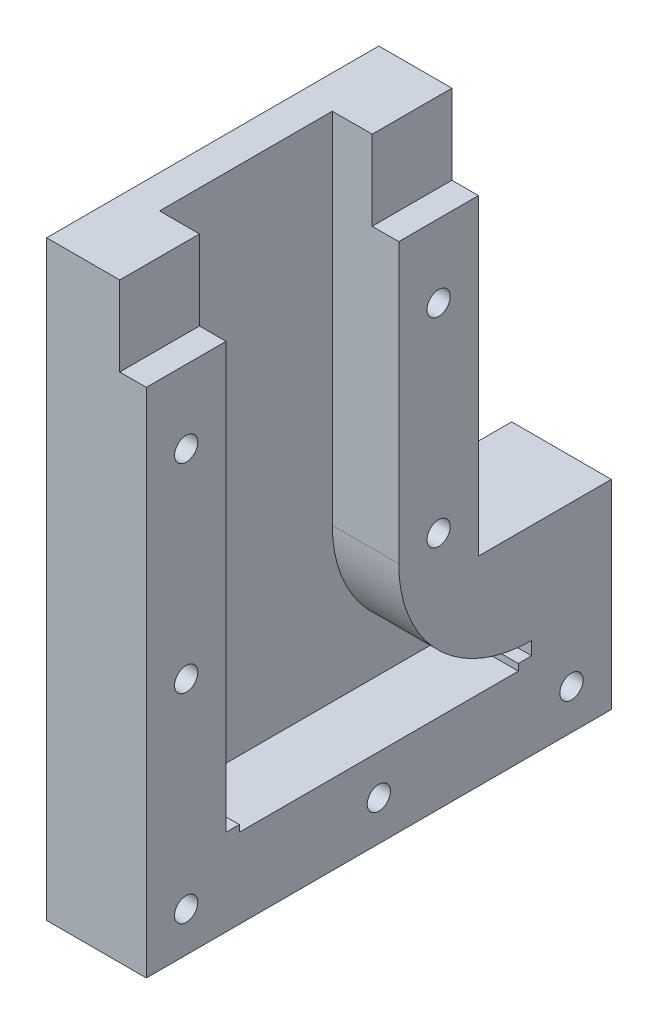
ISO-10303-21;
HEADER;
FILE_DESCRIPTION(('STEP AP214'),'2;1');
FILE_NAME('part.step','',(''),(''),'','','');
FILE_SCHEMA(('AUTOMOTIVE_DESIGN { 1 0 10303 214 1 1 1 1 }'));
ENDSEC;
DATA;
#1=APPLICATION_CONTEXT('core data for automotive mechanical design processes');
#2=APPLICATION_PROTOCOL_DEFINITION('international standard','automotive_design',2000,#1);
#3=PRODUCT_CONTEXT('',#1,'mechanical');
#4=PRODUCT('Part','Part','',(#3));
#5=PRODUCT_RELATED_PRODUCT_CATEGORY('part','',(#4));
#6=PRODUCT_DEFINITION_FORMATION('','',#4);
#7=PRODUCT_DEFINITION_CONTEXT('part definition',#1,'design');
#8=PRODUCT_DEFINITION('design','',#6,#7);
#9=PRODUCT_DEFINITION_SHAPE('','',#8);
#10=(LENGTH_UNIT() NAMED_UNIT(*) SI_UNIT(.MILLI.,.METRE.));
#11=(NAMED_UNIT(*) PLANE_ANGLE_UNIT() SI_UNIT($,.RADIAN.));
#12=(NAMED_UNIT(*) SI_UNIT($,.STERADIAN.) SOLID_ANGLE_UNIT());
#13=UNCERTAINTY_MEASURE_WITH_UNIT(LENGTH_MEASURE(1.E-05),#10,'distance_accuracy_value','');
#14=(GEOMETRIC_REPRESENTATION_CONTEXT(3) GLOBAL_UNCERTAINTY_ASSIGNED_CONTEXT((#13)) GLOBAL_UNIT_ASSIGNED_CONTEXT((#10,
#11,#12)) REPRESENTATION_CONTEXT('',''));
#15=CARTESIAN_POINT('',(0.,0.,0.));
#16=DIRECTION('',(0.,0.,1.));
#17=DIRECTION('',(1.,0.,0.));
#18=AXIS2_PLACEMENT_3D('',#15,#16,#17);
#19=CARTESIAN_POINT('',(5.,-32.5,13.));
#20=DIRECTION('',(0.,-1.,0.));
#21=DIRECTION('',(0.,0.,-1.));
#22=AXIS2_PLACEMENT_3D('',#19,#20,#21);
#23=PLANE('',#22);
#24=DIRECTION('',(0.,0.,-1.));
#25=VECTOR('',#24,1.);
#26=CARTESIAN_POINT('',(15.,-32.5,13.));
#27=LINE('',#26,#25);
#28=CARTESIAN_POINT('',(15.,-32.5,11.));
#29=VERTEX_POINT('',#28);
#30=CARTESIAN_POINT('',(15.,-32.5,-31.));
#31=VERTEX_POINT('',#30);
#32=EDGE_CURVE('E328',#29,#31,#27,.T.);
#33=ORIENTED_EDGE('',*,*,#32,.T.);
#34=DIRECTION('',(-1.,0.,0.));
#35=VECTOR('',#34,1.);
#36=CARTESIAN_POINT('',(8.,-32.5,-31.));
#37=LINE('',#36,#35);
#38=CARTESIAN_POINT('',(5.,-32.5,-31.));
#39=VERTEX_POINT('',#38);
#40=EDGE_CURVE('E48',#31,#39,#37,.T.);
#41=ORIENTED_EDGE('',*,*,#40,.T.);
#42=DIRECTION('',(0.,0.,-1.));
#43=VECTOR('',#42,1.);
#44=CARTESIAN_POINT('',(5.,-32.5,13.));
#45=LINE('',#44,#43);
#46=CARTESIAN_POINT('',(5.,-32.5,11.));
#47=VERTEX_POINT('',#46);
#48=EDGE_CURVE('E317',#47,#39,#45,.T.);
#49=ORIENTED_EDGE('',*,*,#48,.F.);
#50=DIRECTION('',(-1.,0.,0.));
#51=VECTOR('',#50,1.);
#52=CARTESIAN_POINT('',(8.,-32.5,11.));
#53=LINE('',#52,#51);
#54=EDGE_CURVE('E265',#29,#47,#53,.T.);
#55=ORIENTED_EDGE('',*,*,#54,.F.);
#56=EDGE_LOOP('',(#33,#41,#49,#55));
#57=FACE_BOUND('',#56,.T.);
#58=ADVANCED_FACE('F33',(#57),#23,.F.);
#59=CARTESIAN_POINT('',(5.,-29.5,-33.));
#60=DIRECTION('',(0.,0.,-1.));
#61=DIRECTION('',(-1.,0.,0.));
#62=AXIS2_PLACEMENT_3D('',#59,#60,#61);
#63=PLANE('',#62);
#64=DIRECTION('',(-1.,0.,0.));
#65=VECTOR('',#64,1.);
#66=CARTESIAN_POINT('',(15.,-31.5,-33.));
#67=LINE('',#66,#65);
#68=CARTESIAN_POINT('',(15.,-31.5,-33.));
#69=VERTEX_POINT('',#68);
#70=CARTESIAN_POINT('',(8.,-31.5,-33.));
#71=VERTEX_POINT('',#70);
#72=EDGE_CURVE('E56',#69,#71,#67,.T.);
#73=ORIENTED_EDGE('',*,*,#72,.F.);
#74=DIRECTION('',(0.,1.,0.));
#75=VECTOR('',#74,1.);
#76=CARTESIAN_POINT('',(15.,-29.5,-33.));
#77=LINE('',#76,#75);
#78=CARTESIAN_POINT('',(15.,-29.5,-33.));
#79=VERTEX_POINT('',#78);
#80=EDGE_CURVE('E202',#69,#79,#77,.T.);
#81=ORIENTED_EDGE('',*,*,#80,.T.);
#82=DIRECTION('',(1.,0.,0.));
#83=VECTOR('',#82,1.);
#84=CARTESIAN_POINT('',(5.,-29.5,-33.));
#85=LINE('',#84,#83);
#86=CARTESIAN_POINT('',(5.,-29.5,-33.));
#87=VERTEX_POINT('',#86);
#88=EDGE_CURVE('E308',#87,#79,#85,.T.);
#89=ORIENTED_EDGE('',*,*,#88,.F.);
#90=DIRECTION('',(0.,1.,0.));
#91=VECTOR('',#90,1.);
#92=CARTESIAN_POINT('',(5.,-29.5,-33.));
#93=LINE('',#92,#91);
#94=CARTESIAN_POINT('',(5.,-30.5,-33.));
#95=VERTEX_POINT('',#94);
#96=EDGE_CURVE('E303',#95,#87,#93,.T.);
#97=ORIENTED_EDGE('',*,*,#96,.F.);
#98=DIRECTION('',(-1.,0.,0.));
#99=VECTOR('',#98,1.);
#100=CARTESIAN_POINT('',(8.,-30.5,-33.));
#101=LINE('',#100,#99);
#102=CARTESIAN_POINT('',(8.,-30.5,-33.));
#103=VERTEX_POINT('',#102);
#104=EDGE_CURVE('E247',#103,#95,#101,.T.);
#105=ORIENTED_EDGE('',*,*,#104,.F.);
#106=DIRECTION('',(0.,1.,0.));
#107=VECTOR('',#106,1.);
#108=CARTESIAN_POINT('',(8.,-32.5,-33.));
#109=LINE('',#108,#107);
#110=EDGE_CURVE('E234',#71,#103,#109,.T.);
#111=ORIENTED_EDGE('',*,*,#110,.F.);
#112=EDGE_LOOP('',(#73,#81,#89,#97,#105,#111));
#113=FACE_BOUND('',#112,.T.);
#114=ADVANCED_FACE('F434',(#113),#63,.F.);
#115=CARTESIAN_POINT('',(8.,0.,0.));
#116=DIRECTION('',(1.,0.,0.));
#117=DIRECTION('',(0.,0.,-1.));
#118=AXIS2_PLACEMENT_3D('',#115,#116,#117);
#119=PLANE('',#118);
#120=DIRECTION('',(0.,-1.,0.));
#121=VECTOR('',#120,1.);
#122=CARTESIAN_POINT('',(8.,-32.5,-31.));
#123=LINE('',#122,#121);
#124=CARTESIAN_POINT('',(8.,-30.5,-31.));
#125=VERTEX_POINT('',#124);
#126=CARTESIAN_POINT('',(8.,-31.5,-31.));
#127=VERTEX_POINT('',#126);
#128=EDGE_CURVE('E239',#125,#127,#123,.T.);
#129=ORIENTED_EDGE('',*,*,#128,.T.);
#130=DIRECTION('',(0.,0.,1.));
#131=VECTOR('',#130,1.);
#132=CARTESIAN_POINT('',(8.,-31.5,-33.));
#133=LINE('',#132,#131);
#134=EDGE_CURVE('E204',#71,#127,#133,.T.);
#135=ORIENTED_EDGE('',*,*,#134,.F.);
#136=ORIENTED_EDGE('',*,*,#110,.T.);
#137=DIRECTION('',(0.,0.,1.));
#138=VECTOR('',#137,1.);
#139=CARTESIAN_POINT('',(8.,-30.5,-33.));
#140=LINE('',#139,#138);
#141=EDGE_CURVE('E236',#103,#125,#140,.T.);
#142=ORIENTED_EDGE('',*,*,#141,.T.);
#143=EDGE_LOOP('',(#129,#135,#136,#142));
#144=FACE_BOUND('',#143,.T.);
#145=ADVANCED_FACE('F440',(#144),#119,.T.);
#146=CARTESIAN_POINT('',(5.,44.5,13.));
#147=DIRECTION('',(0.,0.,1.));
#148=DIRECTION('',(0.,-1.,0.));
#149=AXIS2_PLACEMENT_3D('',#146,#147,#148);
#150=PLANE('',#149);
#151=DIRECTION('',(-1.,0.,0.));
#152=VECTOR('',#151,1.);
#153=CARTESIAN_POINT('',(15.,-31.5,13.));
#154=LINE('',#153,#152);
#155=CARTESIAN_POINT('',(15.,-31.5,13.));
#156=VERTEX_POINT('',#155);
#157=CARTESIAN_POINT('',(8.,-31.5,13.));
#158=VERTEX_POINT('',#157);
#159=EDGE_CURVE('E225',#156,#158,#154,.T.);
#160=ORIENTED_EDGE('',*,*,#159,.T.);
#161=DIRECTION('',(0.,-1.,0.));
#162=VECTOR('',#161,1.);
#163=CARTESIAN_POINT('',(8.,-32.5,13.));
#164=LINE('',#163,#162);
#165=CARTESIAN_POINT('',(8.,-30.5,13.));
#166=VERTEX_POINT('',#165);
#167=EDGE_CURVE('E250',#166,#158,#164,.T.);
#168=ORIENTED_EDGE('',*,*,#167,.F.);
#169=DIRECTION('',(-1.,0.,0.));
#170=VECTOR('',#169,1.);
#171=CARTESIAN_POINT('',(8.,-30.5,13.));
#172=LINE('',#171,#170);
#173=CARTESIAN_POINT('',(5.,-30.5,13.));
#174=VERTEX_POINT('',#173);
#175=EDGE_CURVE('E257',#166,#174,#172,.T.);
#176=ORIENTED_EDGE('',*,*,#175,.T.);
#177=DIRECTION('',(0.,-1.,0.));
#178=VECTOR('',#177,1.);
#179=CARTESIAN_POINT('',(5.,44.5,13.));
#180=LINE('',#179,#178);
#181=CARTESIAN_POINT('',(5.,44.5,13.));
#182=VERTEX_POINT('',#181);
#183=EDGE_CURVE('E314',#182,#174,#180,.T.);
#184=ORIENTED_EDGE('',*,*,#183,.F.);
#185=DIRECTION('',(1.,0.,0.));
#186=VECTOR('',#185,1.);
#187=CARTESIAN_POINT('',(5.,44.5,13.));
#188=LINE('',#187,#186);
#189=CARTESIAN_POINT('',(11.,44.5,13.));
#190=VERTEX_POINT('',#189);
#191=EDGE_CURVE('E332',#182,#190,#188,.T.);
#192=ORIENTED_EDGE('',*,*,#191,.T.);
#193=DIRECTION('',(0.,1.,0.));
#194=VECTOR('',#193,1.);
#195=CARTESIAN_POINT('',(11.,44.5,13.));
#196=LINE('',#195,#194);
#197=CARTESIAN_POINT('',(11.,32.5,13.));
#198=VERTEX_POINT('',#197);
#199=EDGE_CURVE('E274',#198,#190,#196,.T.);
#200=ORIENTED_EDGE('',*,*,#199,.F.);
#201=DIRECTION('',(1.,0.,0.));
#202=VECTOR('',#201,1.);
#203=CARTESIAN_POINT('',(11.,32.5,13.));
#204=LINE('',#203,#202);
#205=CARTESIAN_POINT('',(15.,32.5,13.));
#206=VERTEX_POINT('',#205);
#207=EDGE_CURVE('E281',#198,#206,#204,.T.);
#208=ORIENTED_EDGE('',*,*,#207,.T.);
#209=DIRECTION('',(0.,-1.,0.));
#210=VECTOR('',#209,1.);
#211=CARTESIAN_POINT('',(15.,44.5,13.));
#212=LINE('',#211,#210);
#213=EDGE_CURVE('E311',#206,#156,#212,.T.);
#214=ORIENTED_EDGE('',*,*,#213,.T.);
#215=EDGE_LOOP('',(#160,#168,#176,#184,#192,#200,#208,#214));
#216=FACE_BOUND('',#215,.T.);
#217=ADVANCED_FACE('F444',(#216),#150,.F.);
#218=CARTESIAN_POINT('',(8.,0.,0.));
#219=DIRECTION('',(-1.,0.,0.));
#220=DIRECTION('',(0.,0.,1.));
#221=AXIS2_PLACEMENT_3D('',#218,#219,#220);
#222=PLANE('',#221);
#223=DIRECTION('',(0.,0.,1.));
#224=VECTOR('',#223,1.);
#225=CARTESIAN_POINT('',(8.,-31.5,13.));
#226=LINE('',#225,#224);
#227=CARTESIAN_POINT('',(8.,-31.5,11.));
#228=VERTEX_POINT('',#227);
#229=EDGE_CURVE('E219',#228,#158,#226,.T.);
#230=ORIENTED_EDGE('',*,*,#229,.F.);
#231=DIRECTION('',(0.,1.,0.));
#232=VECTOR('',#231,1.);
#233=CARTESIAN_POINT('',(8.,-32.5,11.));
#234=LINE('',#233,#232);
#235=CARTESIAN_POINT('',(8.,-30.5,11.));
#236=VERTEX_POINT('',#235);
#237=EDGE_CURVE('E252',#228,#236,#234,.T.);
#238=ORIENTED_EDGE('',*,*,#237,.T.);
#239=DIRECTION('',(0.,0.,1.));
#240=VECTOR('',#239,1.);
#241=CARTESIAN_POINT('',(8.,-30.5,13.));
#242=LINE('',#241,#240);
#243=EDGE_CURVE('E255',#236,#166,#242,.T.);
#244=ORIENTED_EDGE('',*,*,#243,.T.);
#245=ORIENTED_EDGE('',*,*,#167,.T.);
#246=EDGE_LOOP('',(#230,#238,#244,#245));
#247=FACE_BOUND('',#246,.T.);
#248=ADVANCED_FACE('F447',(#247),#222,.F.);
#249=CARTESIAN_POINT('',(5.,0.,0.));
#250=DIRECTION('',(1.,0.,0.));
#251=DIRECTION('',(0.,0.,-1.));
#252=AXIS2_PLACEMENT_3D('',#249,#250,#251);
#253=PLANE('',#252);
#254=DIRECTION('',(0.,-1.,0.));
#255=VECTOR('',#254,1.);
#256=CARTESIAN_POINT('',(5.,-32.5,-31.));
#257=LINE('',#256,#255);
#258=CARTESIAN_POINT('',(5.,-30.5,-31.));
#259=VERTEX_POINT('',#258);
#260=EDGE_CURVE('E237',#259,#39,#257,.T.);
#261=ORIENTED_EDGE('',*,*,#260,.F.);
#262=DIRECTION('',(0.,0.,1.));
#263=VECTOR('',#262,1.);
#264=CARTESIAN_POINT('',(5.,-30.5,-33.));
#265=LINE('',#264,#263);
#266=EDGE_CURVE('E233',#95,#259,#265,.T.);
#267=ORIENTED_EDGE('',*,*,#266,.F.);
#268=ORIENTED_EDGE('',*,*,#96,.T.);
#269=CARTESIAN_POINT('',(5.,-9.50000000000001,-33.));
#270=DIRECTION('',(-1.,0.,0.));
#271=DIRECTION('',(0.,0.,-1.));
#272=AXIS2_PLACEMENT_3D('',#269,#270,#271);
#273=CIRCLE('',#272,20.);
#274=CARTESIAN_POINT('',(5.,-9.50000000000001,-13.));
#275=VERTEX_POINT('',#274);
#276=EDGE_CURVE('E301',#87,#275,#273,.T.);
#277=ORIENTED_EDGE('',*,*,#276,.T.);
#278=DIRECTION('',(0.,1.,0.));
#279=VECTOR('',#278,1.);
#280=CARTESIAN_POINT('',(5.,44.5,-13.));
#281=LINE('',#280,#279);
#282=CARTESIAN_POINT('',(5.,44.5,-13.));
#283=VERTEX_POINT('',#282);
#284=EDGE_CURVE('E321',#275,#283,#281,.T.);
#285=ORIENTED_EDGE('',*,*,#284,.T.);
#286=DIRECTION('',(0.,0.,1.));
#287=VECTOR('',#286,1.);
#288=CARTESIAN_POINT('',(5.,44.5,13.));
#289=LINE('',#288,#287);
#290=EDGE_CURVE('E323',#283,#182,#289,.T.);
#291=ORIENTED_EDGE('',*,*,#290,.T.);
#292=ORIENTED_EDGE('',*,*,#183,.T.);
#293=DIRECTION('',(0.,0.,1.));
#294=VECTOR('',#293,1.);
#295=CARTESIAN_POINT('',(5.,-30.5,13.));
#296=LINE('',#295,#294);
#297=CARTESIAN_POINT('',(5.,-30.5,11.));
#298=VERTEX_POINT('',#297);
#299=EDGE_CURVE('E253',#298,#174,#296,.T.);
#300=ORIENTED_EDGE('',*,*,#299,.F.);
#301=DIRECTION('',(0.,1.,0.));
#302=VECTOR('',#301,1.);
#303=CARTESIAN_POINT('',(5.,-32.5,11.));
#304=LINE('',#303,#302);
#305=EDGE_CURVE('E249',#47,#298,#304,.T.);
#306=ORIENTED_EDGE('',*,*,#305,.F.);
#307=ORIENTED_EDGE('',*,*,#48,.T.);
#308=EDGE_LOOP('',(#261,#267,#268,#277,#285,#291,#292,#300,#306,#307));
#309=FACE_BOUND('',#308,.T.);
#310=ADVANCED_FACE('F462',(#309),#253,.T.);
#311=CARTESIAN_POINT('',(15.,44.5,25.));
#312=DIRECTION('',(0.,-1.,0.));
#313=DIRECTION('',(0.,0.,-1.));
#314=AXIS2_PLACEMENT_3D('',#311,#312,#313);
#315=PLANE('',#314);
#316=DIRECTION('',(0.,0.,1.));
#317=VECTOR('',#316,1.);
#318=CARTESIAN_POINT('',(11.,44.5,25.));
#319=LINE('',#318,#317);
#320=CARTESIAN_POINT('',(11.,44.5,25.));
#321=VERTEX_POINT('',#320);
#322=EDGE_CURVE('E276',#190,#321,#319,.T.);
#323=ORIENTED_EDGE('',*,*,#322,.F.);
#324=ORIENTED_EDGE('',*,*,#191,.F.);
#325=ORIENTED_EDGE('',*,*,#290,.F.);
#326=DIRECTION('',(1.,0.,0.));
#327=VECTOR('',#326,1.);
#328=CARTESIAN_POINT('',(5.,44.5,-13.));
#329=LINE('',#328,#327);
#330=CARTESIAN_POINT('',(11.,44.5,-13.));
#331=VERTEX_POINT('',#330);
#332=EDGE_CURVE('E326',#283,#331,#329,.T.);
#333=ORIENTED_EDGE('',*,*,#332,.T.);
#334=DIRECTION('',(0.,0.,1.));
#335=VECTOR('',#334,1.);
#336=CARTESIAN_POINT('',(11.,44.5,-13.));
#337=LINE('',#336,#335);
#338=CARTESIAN_POINT('',(11.,44.5,-25.));
#339=VERTEX_POINT('',#338);
#340=EDGE_CURVE('E294',#339,#331,#337,.T.);
#341=ORIENTED_EDGE('',*,*,#340,.F.);
#342=DIRECTION('',(-1.,0.,0.));
#343=VECTOR('',#342,1.);
#344=CARTESIAN_POINT('',(15.,44.5,-25.));
#345=LINE('',#344,#343);
#346=CARTESIAN_POINT('',(0.,44.5,-25.));
#347=VERTEX_POINT('',#346);
#348=EDGE_CURVE('E368',#339,#347,#345,.T.);
#349=ORIENTED_EDGE('',*,*,#348,.T.);
#350=DIRECTION('',(0.,0.,1.));
#351=VECTOR('',#350,1.);
#352=CARTESIAN_POINT('',(0.,44.5,25.));
#353=LINE('',#352,#351);
#354=CARTESIAN_POINT('',(0.,44.5,25.));
#355=VERTEX_POINT('',#354);
#356=EDGE_CURVE('E358',#347,#355,#353,.T.);
#357=ORIENTED_EDGE('',*,*,#356,.T.);
#358=DIRECTION('',(-1.,0.,0.));
#359=VECTOR('',#358,1.);
#360=CARTESIAN_POINT('',(15.,44.5,25.));
#361=LINE('',#360,#359);
#362=EDGE_CURVE('E366',#321,#355,#361,.T.);
#363=ORIENTED_EDGE('',*,*,#362,.F.);
#364=EDGE_LOOP('',(#323,#324,#325,#333,#341,#349,#357,#363));
#365=FACE_BOUND('',#364,.T.);
#366=ADVANCED_FACE('F407',(#365),#315,.F.);
#367=CARTESIAN_POINT('',(5.,44.5,-13.));
#368=DIRECTION('',(0.,0.,-1.));
#369=DIRECTION('',(0.,1.,0.));
#370=AXIS2_PLACEMENT_3D('',#367,#368,#369);
#371=PLANE('',#370);
#372=DIRECTION('',(0.,1.,0.));
#373=VECTOR('',#372,1.);
#374=CARTESIAN_POINT('',(15.,44.5,-13.));
#375=LINE('',#374,#373);
#376=CARTESIAN_POINT('',(15.,-9.50000000000001,-13.));
#377=VERTEX_POINT('',#376);
#378=CARTESIAN_POINT('',(15.,32.5,-13.));
#379=VERTEX_POINT('',#378);
#380=EDGE_CURVE('E318',#377,#379,#375,.T.);
#381=ORIENTED_EDGE('',*,*,#380,.T.);
#382=DIRECTION('',(1.,0.,0.));
#383=VECTOR('',#382,1.);
#384=CARTESIAN_POINT('',(11.,32.5,-13.));
#385=LINE('',#384,#383);
#386=CARTESIAN_POINT('',(11.,32.5,-13.));
#387=VERTEX_POINT('',#386);
#388=EDGE_CURVE('E296',#387,#379,#385,.T.);
#389=ORIENTED_EDGE('',*,*,#388,.F.);
#390=DIRECTION('',(0.,-1.,0.));
#391=VECTOR('',#390,1.);
#392=CARTESIAN_POINT('',(11.,44.5,-13.));
#393=LINE('',#392,#391);
#394=EDGE_CURVE('E286',#331,#387,#393,.T.);
#395=ORIENTED_EDGE('',*,*,#394,.F.);
#396=ORIENTED_EDGE('',*,*,#332,.F.);
#397=ORIENTED_EDGE('',*,*,#284,.F.);
#398=DIRECTION('',(1.,0.,0.));
#399=VECTOR('',#398,1.);
#400=CARTESIAN_POINT('',(5.,-9.50000000000001,-13.));
#401=LINE('',#400,#399);
#402=EDGE_CURVE('E305',#275,#377,#401,.T.);
#403=ORIENTED_EDGE('',*,*,#402,.T.);
#404=EDGE_LOOP('',(#381,#389,#395,#396,#397,#403));
#405=FACE_BOUND('',#404,.T.);
#406=ADVANCED_FACE('F416',(#405),#371,.F.);
#407=CARTESIAN_POINT('',(15.,-14.5,-45.));
#408=DIRECTION('',(0.,0.,1.));
#409=DIRECTION('',(0.,-1.,0.));
#410=AXIS2_PLACEMENT_3D('',#407,#408,#409);
#411=PLANE('',#410);
#412=DIRECTION('',(0.,1.,0.));
#413=VECTOR('',#412,1.);
#414=CARTESIAN_POINT('',(0.,-14.5,-45.));
#415=LINE('',#414,#413);
#416=CARTESIAN_POINT('',(0.,-44.5,-45.));
#417=VERTEX_POINT('',#416);
#418=CARTESIAN_POINT('',(0.,-14.5,-45.));
#419=VERTEX_POINT('',#418);
#420=EDGE_CURVE('E335',#417,#419,#415,.T.);
#421=ORIENTED_EDGE('',*,*,#420,.T.);
#422=DIRECTION('',(-1.,0.,0.));
#423=VECTOR('',#422,1.);
#424=CARTESIAN_POINT('',(15.,-14.5,-45.));
#425=LINE('',#424,#423);
#426=CARTESIAN_POINT('',(15.,-14.5,-45.));
#427=VERTEX_POINT('',#426);
#428=EDGE_CURVE('E41',#427,#419,#425,.T.);
#429=ORIENTED_EDGE('',*,*,#428,.F.);
#430=DIRECTION('',(0.,1.,0.));
#431=VECTOR('',#430,1.);
#432=CARTESIAN_POINT('',(15.,-14.5,-45.));
#433=LINE('',#432,#431);
#434=CARTESIAN_POINT('',(15.,-44.5,-45.));
#435=VERTEX_POINT('',#434);
#436=EDGE_CURVE('E341',#435,#427,#433,.T.);
#437=ORIENTED_EDGE('',*,*,#436,.F.);
#438=DIRECTION('',(-1.,0.,0.));
#439=VECTOR('',#438,1.);
#440=CARTESIAN_POINT('',(15.,-44.5,-45.));
#441=LINE('',#440,#439);
#442=EDGE_CURVE('E11',#435,#417,#441,.T.);
#443=ORIENTED_EDGE('',*,*,#442,.T.);
#444=EDGE_LOOP('',(#421,#429,#437,#443));
#445=FACE_BOUND('',#444,.T.);
#446=ADVANCED_FACE('F35',(#445),#411,.F.);
#447=CARTESIAN_POINT('',(15.,-14.5,-25.));
#448=DIRECTION('',(0.,-1.,0.));
#449=DIRECTION('',(0.,0.,-1.));
#450=AXIS2_PLACEMENT_3D('',#447,#448,#449);
#451=PLANE('',#450);
#452=DIRECTION('',(0.,0.,1.));
#453=VECTOR('',#452,1.);
#454=CARTESIAN_POINT('',(0.,-14.5,-25.));
#455=LINE('',#454,#453);
#456=CARTESIAN_POINT('',(0.,-14.5,-25.));
#457=VERTEX_POINT('',#456);
#458=EDGE_CURVE('E353',#419,#457,#455,.T.);
#459=ORIENTED_EDGE('',*,*,#458,.T.);
#460=DIRECTION('',(-1.,0.,0.));
#461=VECTOR('',#460,1.);
#462=CARTESIAN_POINT('',(15.,-14.5,-25.));
#463=LINE('',#462,#461);
#464=CARTESIAN_POINT('',(15.,-14.5,-25.));
#465=VERTEX_POINT('',#464);
#466=EDGE_CURVE('E370',#465,#457,#463,.T.);
#467=ORIENTED_EDGE('',*,*,#466,.F.);
#468=DIRECTION('',(0.,0.,1.));
#469=VECTOR('',#468,1.);
#470=CARTESIAN_POINT('',(15.,-14.5,-25.));
#471=LINE('',#470,#469);
#472=EDGE_CURVE('E344',#427,#465,#471,.T.);
#473=ORIENTED_EDGE('',*,*,#472,.F.);
#474=ORIENTED_EDGE('',*,*,#428,.T.);
#475=EDGE_LOOP('',(#459,#467,#473,#474));
#476=FACE_BOUND('',#475,.T.);
#477=ADVANCED_FACE('F377',(#476),#451,.F.);
#478=CARTESIAN_POINT('',(15.,44.5,-25.));
#479=DIRECTION('',(0.,0.,1.));
#480=DIRECTION('',(0.,-1.,0.));
#481=AXIS2_PLACEMENT_3D('',#478,#479,#480);
#482=PLANE('',#481);
#483=DIRECTION('',(0.,1.,0.));
#484=VECTOR('',#483,1.);
#485=CARTESIAN_POINT('',(11.,44.5,-25.));
#486=LINE('',#485,#484);
#487=CARTESIAN_POINT('',(11.,32.5,-25.));
#488=VERTEX_POINT('',#487);
#489=EDGE_CURVE('E292',#488,#339,#486,.T.);
#490=ORIENTED_EDGE('',*,*,#489,.F.);
#491=DIRECTION('',(1.,0.,0.));
#492=VECTOR('',#491,1.);
#493=CARTESIAN_POINT('',(11.,32.5,-25.));
#494=LINE('',#493,#492);
#495=CARTESIAN_POINT('',(15.,32.5,-25.));
#496=VERTEX_POINT('',#495);
#497=EDGE_CURVE('E280',#488,#496,#494,.T.);
#498=ORIENTED_EDGE('',*,*,#497,.T.);
#499=DIRECTION('',(0.,1.,0.));
#500=VECTOR('',#499,1.);
#501=CARTESIAN_POINT('',(15.,44.5,-25.));
#502=LINE('',#501,#500);
#503=EDGE_CURVE('E346',#465,#496,#502,.T.);
#504=ORIENTED_EDGE('',*,*,#503,.F.);
#505=ORIENTED_EDGE('',*,*,#466,.T.);
#506=DIRECTION('',(0.,1.,0.));
#507=VECTOR('',#506,1.);
#508=CARTESIAN_POINT('',(0.,44.5,-25.));
#509=LINE('',#508,#507);
#510=EDGE_CURVE('E355',#457,#347,#509,.T.);
#511=ORIENTED_EDGE('',*,*,#510,.T.);
#512=ORIENTED_EDGE('',*,*,#348,.F.);
#513=EDGE_LOOP('',(#490,#498,#504,#505,#511,#512));
#514=FACE_BOUND('',#513,.T.);
#515=ADVANCED_FACE('F390',(#514),#482,.F.);
#516=CARTESIAN_POINT('',(15.,44.5,25.));
#517=DIRECTION('',(0.,0.,-1.));
#518=DIRECTION('',(0.,1.,0.));
#519=AXIS2_PLACEMENT_3D('',#516,#517,#518);
#520=PLANE('',#519);
#521=DIRECTION('',(0.,-1.,0.));
#522=VECTOR('',#521,1.);
#523=CARTESIAN_POINT('',(15.,44.5,25.));
#524=LINE('',#523,#522);
#525=CARTESIAN_POINT('',(15.,32.5,25.));
#526=VERTEX_POINT('',#525);
#527=CARTESIAN_POINT('',(15.,-44.5,25.));
#528=VERTEX_POINT('',#527);
#529=EDGE_CURVE('E349',#526,#528,#524,.T.);
#530=ORIENTED_EDGE('',*,*,#529,.F.);
#531=DIRECTION('',(1.,0.,0.));
#532=VECTOR('',#531,1.);
#533=CARTESIAN_POINT('',(11.,32.5,25.));
#534=LINE('',#533,#532);
#535=CARTESIAN_POINT('',(11.,32.5,25.));
#536=VERTEX_POINT('',#535);
#537=EDGE_CURVE('E278',#536,#526,#534,.T.);
#538=ORIENTED_EDGE('',*,*,#537,.F.);
#539=DIRECTION('',(0.,-1.,0.));
#540=VECTOR('',#539,1.);
#541=CARTESIAN_POINT('',(11.,44.5,25.));
#542=LINE('',#541,#540);
#543=EDGE_CURVE('E268',#321,#536,#542,.T.);
#544=ORIENTED_EDGE('',*,*,#543,.F.);
#545=ORIENTED_EDGE('',*,*,#362,.T.);
#546=DIRECTION('',(0.,-1.,0.));
#547=VECTOR('',#546,1.);
#548=CARTESIAN_POINT('',(0.,44.5,25.));
#549=LINE('',#548,#547);
#550=CARTESIAN_POINT('',(0.,-44.5,25.));
#551=VERTEX_POINT('',#550);
#552=EDGE_CURVE('E361',#355,#551,#549,.T.);
#553=ORIENTED_EDGE('',*,*,#552,.T.);
#554=DIRECTION('',(-1.,0.,0.));
#555=VECTOR('',#554,1.);
#556=CARTESIAN_POINT('',(15.,-44.5,25.));
#557=LINE('',#556,#555);
#558=EDGE_CURVE('E351',#528,#551,#557,.T.);
#559=ORIENTED_EDGE('',*,*,#558,.F.);
#560=EDGE_LOOP('',(#530,#538,#544,#545,#553,#559));
#561=FACE_BOUND('',#560,.T.);
#562=ADVANCED_FACE('F401',(#561),#520,.F.);
#563=CARTESIAN_POINT('',(15.,-44.5,25.));
#564=DIRECTION('',(0.,1.,0.));
#565=DIRECTION('',(0.,0.,1.));
#566=AXIS2_PLACEMENT_3D('',#563,#564,#565);
#567=PLANE('',#566);
#568=DIRECTION('',(0.,0.,-1.));
#569=VECTOR('',#568,1.);
#570=CARTESIAN_POINT('',(0.,-44.5,25.));
#571=LINE('',#570,#569);
#572=EDGE_CURVE('E342',#551,#417,#571,.T.);
#573=ORIENTED_EDGE('',*,*,#572,.T.);
#574=ORIENTED_EDGE('',*,*,#442,.F.);
#575=DIRECTION('',(0.,0.,-1.));
#576=VECTOR('',#575,1.);
#577=CARTESIAN_POINT('',(15.,-44.5,-25.));
#578=LINE('',#577,#576);
#579=EDGE_CURVE('E338',#528,#435,#578,.T.);
#580=ORIENTED_EDGE('',*,*,#579,.F.);
#581=ORIENTED_EDGE('',*,*,#558,.T.);
#582=EDGE_LOOP('',(#573,#574,#580,#581));
#583=FACE_BOUND('',#582,.T.);
#584=ADVANCED_FACE('F397',(#583),#567,.F.);
#585=CARTESIAN_POINT('',(15.,0.,0.));
#586=DIRECTION('',(-1.,0.,0.));
#587=DIRECTION('',(0.,0.,1.));
#588=AXIS2_PLACEMENT_3D('',#585,#586,#587);
#589=PLANE('',#588);
#590=CARTESIAN_POINT('',(15.,-8.50000000000001,19.));
#591=DIRECTION('',(1.,0.,0.));
#592=DIRECTION('',(0.,0.,-1.));
#593=AXIS2_PLACEMENT_3D('',#590,#591,#592);
#594=CIRCLE('',#593,1.75);
#595=CARTESIAN_POINT('',(15.,-8.50000000000001,17.25));
#596=VERTEX_POINT('',#595);
#597=EDGE_CURVE('E713',#596,#596,#594,.T.);
#598=ORIENTED_EDGE('',*,*,#597,.F.);
#599=EDGE_LOOP('',(#598));
#600=FACE_BOUND('',#599,.T.);
#601=CARTESIAN_POINT('',(15.,-38.5,19.));
#602=DIRECTION('',(1.,0.,0.));
#603=DIRECTION('',(0.,0.,-1.));
#604=AXIS2_PLACEMENT_3D('',#601,#602,#603);
#605=CIRCLE('',#604,1.75);
#606=CARTESIAN_POINT('',(15.,-38.5,17.25));
#607=VERTEX_POINT('',#606);
#608=EDGE_CURVE('E719',#607,#607,#605,.T.);
#609=ORIENTED_EDGE('',*,*,#608,.F.);
#610=EDGE_LOOP('',(#609));
#611=FACE_BOUND('',#610,.T.);
#612=CARTESIAN_POINT('',(15.,-38.5,-9.99999999999997));
#613=DIRECTION('',(1.,0.,0.));
#614=DIRECTION('',(0.,0.,-1.));
#615=AXIS2_PLACEMENT_3D('',#612,#613,#614);
#616=CIRCLE('',#615,1.75);
#617=CARTESIAN_POINT('',(15.,-38.5,-11.75));
#618=VERTEX_POINT('',#617);
#619=EDGE_CURVE('E725',#618,#618,#616,.T.);
#620=ORIENTED_EDGE('',*,*,#619,.F.);
#621=EDGE_LOOP('',(#620));
#622=FACE_BOUND('',#621,.T.);
#623=CARTESIAN_POINT('',(15.,-38.5,-39.));
#624=DIRECTION('',(1.,0.,0.));
#625=DIRECTION('',(0.,0.,-1.));
#626=AXIS2_PLACEMENT_3D('',#623,#624,#625);
#627=CIRCLE('',#626,1.75);
#628=CARTESIAN_POINT('',(15.,-38.5,-40.75));
#629=VERTEX_POINT('',#628);
#630=EDGE_CURVE('E701',#629,#629,#627,.T.);
#631=ORIENTED_EDGE('',*,*,#630,.F.);
#632=EDGE_LOOP('',(#631));
#633=FACE_BOUND('',#632,.T.);
#634=CARTESIAN_POINT('',(15.,-8.50000000000001,-19.));
#635=DIRECTION('',(1.,0.,0.));
#636=DIRECTION('',(0.,0.,-1.));
#637=AXIS2_PLACEMENT_3D('',#634,#635,#636);
#638=CIRCLE('',#637,1.75);
#639=CARTESIAN_POINT('',(15.,-8.50000000000001,-20.75));
#640=VERTEX_POINT('',#639);
#641=EDGE_CURVE('E697',#640,#640,#638,.T.);
#642=ORIENTED_EDGE('',*,*,#641,.F.);
#643=EDGE_LOOP('',(#642));
#644=FACE_BOUND('',#643,.T.);
#645=CARTESIAN_POINT('',(15.,21.5,-19.));
#646=DIRECTION('',(1.,0.,0.));
#647=DIRECTION('',(0.,0.,-1.));
#648=AXIS2_PLACEMENT_3D('',#645,#646,#647);
#649=CIRCLE('',#648,1.75);
#650=CARTESIAN_POINT('',(15.,21.5,-20.75));
#651=VERTEX_POINT('',#650);
#652=EDGE_CURVE('E704',#651,#651,#649,.T.);
#653=ORIENTED_EDGE('',*,*,#652,.F.);
#654=EDGE_LOOP('',(#653));
#655=FACE_BOUND('',#654,.T.);
#656=CARTESIAN_POINT('',(15.,21.5,19.));
#657=DIRECTION('',(1.,0.,0.));
#658=DIRECTION('',(0.,0.,-1.));
#659=AXIS2_PLACEMENT_3D('',#656,#657,#658);
#660=CIRCLE('',#659,1.75);
#661=CARTESIAN_POINT('',(15.,21.5,17.25));
#662=VERTEX_POINT('',#661);
#663=EDGE_CURVE('E712',#662,#662,#660,.T.);
#664=ORIENTED_EDGE('',*,*,#663,.F.);
#665=EDGE_LOOP('',(#664));
#666=FACE_BOUND('',#665,.T.);
#667=ORIENTED_EDGE('',*,*,#80,.F.);
#668=DIRECTION('',(0.,0.,1.));
#669=VECTOR('',#668,1.);
#670=CARTESIAN_POINT('',(15.,-31.5,-33.));
#671=LINE('',#670,#669);
#672=CARTESIAN_POINT('',(15.,-31.5,-31.));
#673=VERTEX_POINT('',#672);
#674=EDGE_CURVE('E196',#69,#673,#671,.T.);
#675=ORIENTED_EDGE('',*,*,#674,.T.);
#676=DIRECTION('',(0.,-1.,0.));
#677=VECTOR('',#676,1.);
#678=CARTESIAN_POINT('',(15.,-32.5,-31.));
#679=LINE('',#678,#677);
#680=EDGE_CURVE('E200',#673,#31,#679,.T.);
#681=ORIENTED_EDGE('',*,*,#680,.T.);
#682=ORIENTED_EDGE('',*,*,#32,.F.);
#683=DIRECTION('',(0.,1.,0.));
#684=VECTOR('',#683,1.);
#685=CARTESIAN_POINT('',(15.,-32.5,11.));
#686=LINE('',#685,#684);
#687=CARTESIAN_POINT('',(15.,-31.5,11.));
#688=VERTEX_POINT('',#687);
#689=EDGE_CURVE('E220',#29,#688,#686,.T.);
#690=ORIENTED_EDGE('',*,*,#689,.T.);
#691=DIRECTION('',(0.,0.,1.));
#692=VECTOR('',#691,1.);
#693=CARTESIAN_POINT('',(15.,-31.5,13.));
#694=LINE('',#693,#692);
#695=EDGE_CURVE('E222',#688,#156,#694,.T.);
#696=ORIENTED_EDGE('',*,*,#695,.T.);
#697=ORIENTED_EDGE('',*,*,#213,.F.);
#698=DIRECTION('',(0.,0.,-1.));
#699=VECTOR('',#698,1.);
#700=CARTESIAN_POINT('',(15.,32.5,25.));
#701=LINE('',#700,#699);
#702=EDGE_CURVE('E272',#526,#206,#701,.T.);
#703=ORIENTED_EDGE('',*,*,#702,.F.);
#704=ORIENTED_EDGE('',*,*,#529,.T.);
#705=ORIENTED_EDGE('',*,*,#579,.T.);
#706=ORIENTED_EDGE('',*,*,#436,.T.);
#707=ORIENTED_EDGE('',*,*,#472,.T.);
#708=ORIENTED_EDGE('',*,*,#503,.T.);
#709=DIRECTION('',(0.,0.,-1.));
#710=VECTOR('',#709,1.);
#711=CARTESIAN_POINT('',(15.,32.5,-13.));
#712=LINE('',#711,#710);
#713=EDGE_CURVE('E267',#379,#496,#712,.T.);
#714=ORIENTED_EDGE('',*,*,#713,.F.);
#715=ORIENTED_EDGE('',*,*,#380,.F.);
#716=CARTESIAN_POINT('',(15.,-9.50000000000001,-33.));
#717=DIRECTION('',(-1.,0.,0.));
#718=DIRECTION('',(0.,0.,-1.));
#719=AXIS2_PLACEMENT_3D('',#716,#717,#718);
#720=CIRCLE('',#719,20.);
#721=EDGE_CURVE('E284',#79,#377,#720,.T.);
#722=ORIENTED_EDGE('',*,*,#721,.F.);
#723=EDGE_LOOP('',(#667,#675,#681,#682,#690,#696,#697,#703,#704,#705,#706,#707,#708,#714,#715,#722));
#724=FACE_BOUND('',#723,.T.);
#725=ADVANCED_FACE('F198',(#600,#611,#622,#633,#644,#655,#666,#724),#589,.F.);
#726=CARTESIAN_POINT('',(0.,0.,0.));
#727=DIRECTION('',(-1.,0.,0.));
#728=DIRECTION('',(0.,0.,1.));
#729=AXIS2_PLACEMENT_3D('',#726,#727,#728);
#730=PLANE('',#729);
#731=CARTESIAN_POINT('',(0.,-8.50000000000001,19.));
#732=DIRECTION('',(1.,0.,0.));
#733=DIRECTION('',(0.,0.,-1.));
#734=AXIS2_PLACEMENT_3D('',#731,#732,#733);
#735=CIRCLE('',#734,1.75);
#736=CARTESIAN_POINT('',(0.,-8.50000000000001,17.25));
#737=VERTEX_POINT('',#736);
#738=EDGE_CURVE('E709',#737,#737,#735,.T.);
#739=ORIENTED_EDGE('',*,*,#738,.T.);
#740=EDGE_LOOP('',(#739));
#741=FACE_BOUND('',#740,.T.);
#742=CARTESIAN_POINT('',(0.,-38.5,19.));
#743=DIRECTION('',(1.,0.,0.));
#744=DIRECTION('',(0.,0.,-1.));
#745=AXIS2_PLACEMENT_3D('',#742,#743,#744);
#746=CIRCLE('',#745,1.75);
#747=CARTESIAN_POINT('',(0.,-38.5,17.25));
#748=VERTEX_POINT('',#747);
#749=EDGE_CURVE('E716',#748,#748,#746,.T.);
#750=ORIENTED_EDGE('',*,*,#749,.T.);
#751=EDGE_LOOP('',(#750));
#752=FACE_BOUND('',#751,.T.);
#753=CARTESIAN_POINT('',(0.,-38.5,-9.99999999999997));
#754=DIRECTION('',(1.,0.,0.));
#755=DIRECTION('',(0.,0.,-1.));
#756=AXIS2_PLACEMENT_3D('',#753,#754,#755);
#757=CIRCLE('',#756,1.75);
#758=CARTESIAN_POINT('',(0.,-38.5,-11.75));
#759=VERTEX_POINT('',#758);
#760=EDGE_CURVE('E722',#759,#759,#757,.T.);
#761=ORIENTED_EDGE('',*,*,#760,.T.);
#762=EDGE_LOOP('',(#761));
#763=FACE_BOUND('',#762,.T.);
#764=CARTESIAN_POINT('',(0.,-38.5,-39.));
#765=DIRECTION('',(1.,0.,0.));
#766=DIRECTION('',(0.,0.,-1.));
#767=AXIS2_PLACEMENT_3D('',#764,#765,#766);
#768=CIRCLE('',#767,1.75);
#769=CARTESIAN_POINT('',(0.,-38.5,-40.75));
#770=VERTEX_POINT('',#769);
#771=EDGE_CURVE('E728',#770,#770,#768,.T.);
#772=ORIENTED_EDGE('',*,*,#771,.T.);
#773=EDGE_LOOP('',(#772));
#774=FACE_BOUND('',#773,.T.);
#775=CARTESIAN_POINT('',(0.,-8.50000000000001,-19.));
#776=DIRECTION('',(1.,0.,0.));
#777=DIRECTION('',(0.,0.,-1.));
#778=AXIS2_PLACEMENT_3D('',#775,#776,#777);
#779=CIRCLE('',#778,1.75);
#780=CARTESIAN_POINT('',(0.,-8.50000000000001,-20.75));
#781=VERTEX_POINT('',#780);
#782=EDGE_CURVE('E694',#781,#781,#779,.T.);
#783=ORIENTED_EDGE('',*,*,#782,.T.);
#784=EDGE_LOOP('',(#783));
#785=FACE_BOUND('',#784,.T.);
#786=CARTESIAN_POINT('',(0.,21.5,-19.));
#787=DIRECTION('',(1.,0.,0.));
#788=DIRECTION('',(0.,0.,-1.));
#789=AXIS2_PLACEMENT_3D('',#786,#787,#788);
#790=CIRCLE('',#789,1.75);
#791=CARTESIAN_POINT('',(0.,21.5,-20.75));
#792=VERTEX_POINT('',#791);
#793=EDGE_CURVE('E699',#792,#792,#790,.T.);
#794=ORIENTED_EDGE('',*,*,#793,.T.);
#795=EDGE_LOOP('',(#794));
#796=FACE_BOUND('',#795,.T.);
#797=CARTESIAN_POINT('',(0.,21.5,19.));
#798=DIRECTION('',(1.,0.,0.));
#799=DIRECTION('',(0.,0.,-1.));
#800=AXIS2_PLACEMENT_3D('',#797,#798,#799);
#801=CIRCLE('',#800,1.75);
#802=CARTESIAN_POINT('',(0.,21.5,17.25));
#803=VERTEX_POINT('',#802);
#804=EDGE_CURVE('E216',#803,#803,#801,.T.);
#805=ORIENTED_EDGE('',*,*,#804,.T.);
#806=EDGE_LOOP('',(#805));
#807=FACE_BOUND('',#806,.T.);
#808=ORIENTED_EDGE('',*,*,#420,.F.);
#809=ORIENTED_EDGE('',*,*,#572,.F.);
#810=ORIENTED_EDGE('',*,*,#552,.F.);
#811=ORIENTED_EDGE('',*,*,#356,.F.);
#812=ORIENTED_EDGE('',*,*,#510,.F.);
#813=ORIENTED_EDGE('',*,*,#458,.F.);
#814=EDGE_LOOP('',(#808,#809,#810,#811,#812,#813));
#815=FACE_BOUND('',#814,.T.);
#816=ADVANCED_FACE('F383',(#741,#752,#763,#774,#785,#796,#807,#815),#730,.T.);
#817=CARTESIAN_POINT('',(5.,-9.50000000000001,-33.));
#818=DIRECTION('',(1.,0.,0.));
#819=DIRECTION('',(0.,0.,-1.));
#820=AXIS2_PLACEMENT_3D('',#817,#818,#819);
#821=CYLINDRICAL_SURFACE('',#820,20.);
#822=ORIENTED_EDGE('',*,*,#721,.T.);
#823=ORIENTED_EDGE('',*,*,#402,.F.);
#824=ORIENTED_EDGE('',*,*,#276,.F.);
#825=ORIENTED_EDGE('',*,*,#88,.T.);
#826=EDGE_LOOP('',(#822,#823,#824,#825));
#827=FACE_BOUND('',#826,.T.);
#828=ADVANCED_FACE('F454',(#827),#821,.T.);
#829=CARTESIAN_POINT('',(11.,32.5,25.));
#830=DIRECTION('',(0.,-1.,0.));
#831=DIRECTION('',(0.,0.,-1.));
#832=AXIS2_PLACEMENT_3D('',#829,#830,#831);
#833=PLANE('',#832);
#834=ORIENTED_EDGE('',*,*,#702,.T.);
#835=ORIENTED_EDGE('',*,*,#207,.F.);
#836=DIRECTION('',(0.,0.,-1.));
#837=VECTOR('',#836,1.);
#838=CARTESIAN_POINT('',(11.,32.5,25.));
#839=LINE('',#838,#837);
#840=EDGE_CURVE('E271',#536,#198,#839,.T.);
#841=ORIENTED_EDGE('',*,*,#840,.F.);
#842=ORIENTED_EDGE('',*,*,#537,.T.);
#843=EDGE_LOOP('',(#834,#835,#841,#842));
#844=FACE_BOUND('',#843,.T.);
#845=ADVANCED_FACE('F429',(#844),#833,.F.);
#846=CARTESIAN_POINT('',(11.,0.,0.));
#847=DIRECTION('',(1.,0.,0.));
#848=DIRECTION('',(0.,0.,-1.));
#849=AXIS2_PLACEMENT_3D('',#846,#847,#848);
#850=PLANE('',#849);
#851=ORIENTED_EDGE('',*,*,#543,.T.);
#852=ORIENTED_EDGE('',*,*,#840,.T.);
#853=ORIENTED_EDGE('',*,*,#199,.T.);
#854=ORIENTED_EDGE('',*,*,#322,.T.);
#855=EDGE_LOOP('',(#851,#852,#853,#854));
#856=FACE_BOUND('',#855,.T.);
#857=ADVANCED_FACE('F421',(#856),#850,.T.);
#858=CARTESIAN_POINT('',(11.,32.5,-13.));
#859=DIRECTION('',(0.,-1.,0.));
#860=DIRECTION('',(0.,0.,-1.));
#861=AXIS2_PLACEMENT_3D('',#858,#859,#860);
#862=PLANE('',#861);
#863=ORIENTED_EDGE('',*,*,#713,.T.);
#864=ORIENTED_EDGE('',*,*,#497,.F.);
#865=DIRECTION('',(0.,0.,-1.));
#866=VECTOR('',#865,1.);
#867=CARTESIAN_POINT('',(11.,32.5,-13.));
#868=LINE('',#867,#866);
#869=EDGE_CURVE('E289',#387,#488,#868,.T.);
#870=ORIENTED_EDGE('',*,*,#869,.F.);
#871=ORIENTED_EDGE('',*,*,#388,.T.);
#872=EDGE_LOOP('',(#863,#864,#870,#871));
#873=FACE_BOUND('',#872,.T.);
#874=ADVANCED_FACE('F419',(#873),#862,.F.);
#875=CARTESIAN_POINT('',(11.,0.,0.));
#876=DIRECTION('',(1.,0.,0.));
#877=DIRECTION('',(0.,0.,-1.));
#878=AXIS2_PLACEMENT_3D('',#875,#876,#877);
#879=PLANE('',#878);
#880=ORIENTED_EDGE('',*,*,#394,.T.);
#881=ORIENTED_EDGE('',*,*,#869,.T.);
#882=ORIENTED_EDGE('',*,*,#489,.T.);
#883=ORIENTED_EDGE('',*,*,#340,.T.);
#884=EDGE_LOOP('',(#880,#881,#882,#883));
#885=FACE_BOUND('',#884,.T.);
#886=ADVANCED_FACE('F413',(#885),#879,.T.);
#887=CARTESIAN_POINT('',(8.,-32.5,11.));
#888=DIRECTION('',(0.,0.,1.));
#889=DIRECTION('',(1.,0.,0.));
#890=AXIS2_PLACEMENT_3D('',#887,#888,#889);
#891=PLANE('',#890);
#892=ORIENTED_EDGE('',*,*,#305,.T.);
#893=DIRECTION('',(-1.,0.,0.));
#894=VECTOR('',#893,1.);
#895=CARTESIAN_POINT('',(8.,-30.5,11.));
#896=LINE('',#895,#894);
#897=EDGE_CURVE('E263',#236,#298,#896,.T.);
#898=ORIENTED_EDGE('',*,*,#897,.F.);
#899=ORIENTED_EDGE('',*,*,#237,.F.);
#900=DIRECTION('',(-1.,0.,0.));
#901=VECTOR('',#900,1.);
#902=CARTESIAN_POINT('',(15.,-31.5,11.));
#903=LINE('',#902,#901);
#904=EDGE_CURVE('E230',#688,#228,#903,.T.);
#905=ORIENTED_EDGE('',*,*,#904,.F.);
#906=ORIENTED_EDGE('',*,*,#689,.F.);
#907=ORIENTED_EDGE('',*,*,#54,.T.);
#908=EDGE_LOOP('',(#892,#898,#899,#905,#906,#907));
#909=FACE_BOUND('',#908,.T.);
#910=ADVANCED_FACE('F427',(#909),#891,.F.);
#911=CARTESIAN_POINT('',(8.,-30.5,13.));
#912=DIRECTION('',(0.,-1.,0.));
#913=DIRECTION('',(0.,0.,-1.));
#914=AXIS2_PLACEMENT_3D('',#911,#912,#913);
#915=PLANE('',#914);
#916=ORIENTED_EDGE('',*,*,#299,.T.);
#917=ORIENTED_EDGE('',*,*,#175,.F.);
#918=ORIENTED_EDGE('',*,*,#243,.F.);
#919=ORIENTED_EDGE('',*,*,#897,.T.);
#920=EDGE_LOOP('',(#916,#917,#918,#919));
#921=FACE_BOUND('',#920,.T.);
#922=ADVANCED_FACE('F525',(#921),#915,.F.);
#923=CARTESIAN_POINT('',(8.,-30.5,-33.));
#924=DIRECTION('',(0.,-1.,0.));
#925=DIRECTION('',(0.,0.,-1.));
#926=AXIS2_PLACEMENT_3D('',#923,#924,#925);
#927=PLANE('',#926);
#928=ORIENTED_EDGE('',*,*,#266,.T.);
#929=DIRECTION('',(-1.,0.,0.));
#930=VECTOR('',#929,1.);
#931=CARTESIAN_POINT('',(8.,-30.5,-31.));
#932=LINE('',#931,#930);
#933=EDGE_CURVE('E244',#125,#259,#932,.T.);
#934=ORIENTED_EDGE('',*,*,#933,.F.);
#935=ORIENTED_EDGE('',*,*,#141,.F.);
#936=ORIENTED_EDGE('',*,*,#104,.T.);
#937=EDGE_LOOP('',(#928,#934,#935,#936));
#938=FACE_BOUND('',#937,.T.);
#939=ADVANCED_FACE('F521',(#938),#927,.F.);
#940=CARTESIAN_POINT('',(8.,-32.5,-31.));
#941=DIRECTION('',(0.,0.,-1.));
#942=DIRECTION('',(-1.,0.,0.));
#943=AXIS2_PLACEMENT_3D('',#940,#941,#942);
#944=PLANE('',#943);
#945=ORIENTED_EDGE('',*,*,#260,.T.);
#946=ORIENTED_EDGE('',*,*,#40,.F.);
#947=ORIENTED_EDGE('',*,*,#680,.F.);
#948=DIRECTION('',(-1.,0.,0.));
#949=VECTOR('',#948,1.);
#950=CARTESIAN_POINT('',(15.,-31.5,-31.));
#951=LINE('',#950,#949);
#952=EDGE_CURVE('E208',#673,#127,#951,.T.);
#953=ORIENTED_EDGE('',*,*,#952,.T.);
#954=ORIENTED_EDGE('',*,*,#128,.F.);
#955=ORIENTED_EDGE('',*,*,#933,.T.);
#956=EDGE_LOOP('',(#945,#946,#947,#953,#954,#955));
#957=FACE_BOUND('',#956,.T.);
#958=ADVANCED_FACE('F212',(#957),#944,.F.);
#959=CARTESIAN_POINT('',(15.,-31.5,13.));
#960=DIRECTION('',(0.,-1.,0.));
#961=DIRECTION('',(0.,0.,-1.));
#962=AXIS2_PLACEMENT_3D('',#959,#960,#961);
#963=PLANE('',#962);
#964=ORIENTED_EDGE('',*,*,#229,.T.);
#965=ORIENTED_EDGE('',*,*,#159,.F.);
#966=ORIENTED_EDGE('',*,*,#695,.F.);
#967=ORIENTED_EDGE('',*,*,#904,.T.);
#968=EDGE_LOOP('',(#964,#965,#966,#967));
#969=FACE_BOUND('',#968,.T.);
#970=ADVANCED_FACE('F626',(#969),#963,.F.);
#971=CARTESIAN_POINT('',(15.,-31.5,-33.));
#972=DIRECTION('',(0.,-1.,0.));
#973=DIRECTION('',(0.,0.,-1.));
#974=AXIS2_PLACEMENT_3D('',#971,#972,#973);
#975=PLANE('',#974);
#976=ORIENTED_EDGE('',*,*,#134,.T.);
#977=ORIENTED_EDGE('',*,*,#952,.F.);
#978=ORIENTED_EDGE('',*,*,#674,.F.);
#979=ORIENTED_EDGE('',*,*,#72,.T.);
#980=EDGE_LOOP('',(#976,#977,#978,#979));
#981=FACE_BOUND('',#980,.T.);
#982=ADVANCED_FACE('F209',(#981),#975,.F.);
#983=CARTESIAN_POINT('',(0.,21.5,19.));
#984=DIRECTION('',(1.,0.,0.));
#985=DIRECTION('',(0.,0.,-1.));
#986=AXIS2_PLACEMENT_3D('',#983,#984,#985);
#987=CYLINDRICAL_SURFACE('',#986,1.75);
#988=ORIENTED_EDGE('',*,*,#804,.F.);
#989=EDGE_LOOP('',(#988));
#990=FACE_BOUND('',#989,.T.);
#991=ORIENTED_EDGE('',*,*,#663,.T.);
#992=EDGE_LOOP('',(#991));
#993=FACE_BOUND('',#992,.T.);
#994=ADVANCED_FACE('F625',(#990,#993),#987,.F.);
#995=CARTESIAN_POINT('',(0.,21.5,-19.));
#996=DIRECTION('',(1.,0.,0.));
#997=DIRECTION('',(0.,0.,-1.));
#998=AXIS2_PLACEMENT_3D('',#995,#996,#997);
#999=CYLINDRICAL_SURFACE('',#998,1.75);
#1000=ORIENTED_EDGE('',*,*,#793,.F.);
#1001=EDGE_LOOP('',(#1000));
#1002=FACE_BOUND('',#1001,.T.);
#1003=ORIENTED_EDGE('',*,*,#652,.T.);
#1004=EDGE_LOOP('',(#1003));
#1005=FACE_BOUND('',#1004,.T.);
#1006=ADVANCED_FACE('F665',(#1002,#1005),#999,.F.);
#1007=CARTESIAN_POINT('',(0.,-8.50000000000001,-19.));
#1008=DIRECTION('',(1.,0.,0.));
#1009=DIRECTION('',(0.,0.,-1.));
#1010=AXIS2_PLACEMENT_3D('',#1007,#1008,#1009);
#1011=CYLINDRICAL_SURFACE('',#1010,1.75);
#1012=ORIENTED_EDGE('',*,*,#782,.F.);
#1013=EDGE_LOOP('',(#1012));
#1014=FACE_BOUND('',#1013,.T.);
#1015=ORIENTED_EDGE('',*,*,#641,.T.);
#1016=EDGE_LOOP('',(#1015));
#1017=FACE_BOUND('',#1016,.T.);
#1018=ADVANCED_FACE('F671',(#1014,#1017),#1011,.F.);
#1019=CARTESIAN_POINT('',(0.,-38.5,-39.));
#1020=DIRECTION('',(1.,0.,0.));
#1021=DIRECTION('',(0.,0.,-1.));
#1022=AXIS2_PLACEMENT_3D('',#1019,#1020,#1021);
#1023=CYLINDRICAL_SURFACE('',#1022,1.75);
#1024=ORIENTED_EDGE('',*,*,#771,.F.);
#1025=EDGE_LOOP('',(#1024));
#1026=FACE_BOUND('',#1025,.T.);
#1027=ORIENTED_EDGE('',*,*,#630,.T.);
#1028=EDGE_LOOP('',(#1027));
#1029=FACE_BOUND('',#1028,.T.);
#1030=ADVANCED_FACE('F667',(#1026,#1029),#1023,.F.);
#1031=CARTESIAN_POINT('',(0.,-38.5,-9.99999999999997));
#1032=DIRECTION('',(1.,0.,0.));
#1033=DIRECTION('',(0.,0.,-1.));
#1034=AXIS2_PLACEMENT_3D('',#1031,#1032,#1033);
#1035=CYLINDRICAL_SURFACE('',#1034,1.75);
#1036=ORIENTED_EDGE('',*,*,#760,.F.);
#1037=EDGE_LOOP('',(#1036));
#1038=FACE_BOUND('',#1037,.T.);
#1039=ORIENTED_EDGE('',*,*,#619,.T.);
#1040=EDGE_LOOP('',(#1039));
#1041=FACE_BOUND('',#1040,.T.);
#1042=ADVANCED_FACE('F670',(#1038,#1041),#1035,.F.);
#1043=CARTESIAN_POINT('',(0.,-38.5,19.));
#1044=DIRECTION('',(1.,0.,0.));
#1045=DIRECTION('',(0.,0.,-1.));
#1046=AXIS2_PLACEMENT_3D('',#1043,#1044,#1045);
#1047=CYLINDRICAL_SURFACE('',#1046,1.75);
#1048=ORIENTED_EDGE('',*,*,#749,.F.);
#1049=EDGE_LOOP('',(#1048));
#1050=FACE_BOUND('',#1049,.T.);
#1051=ORIENTED_EDGE('',*,*,#608,.T.);
#1052=EDGE_LOOP('',(#1051));
#1053=FACE_BOUND('',#1052,.T.);
#1054=ADVANCED_FACE('F675',(#1050,#1053),#1047,.F.);
#1055=CARTESIAN_POINT('',(0.,-8.50000000000001,19.));
#1056=DIRECTION('',(1.,0.,0.));
#1057=DIRECTION('',(0.,0.,-1.));
#1058=AXIS2_PLACEMENT_3D('',#1055,#1056,#1057);
#1059=CYLINDRICAL_SURFACE('',#1058,1.75);
#1060=ORIENTED_EDGE('',*,*,#738,.F.);
#1061=EDGE_LOOP('',(#1060));
#1062=FACE_BOUND('',#1061,.T.);
#1063=ORIENTED_EDGE('',*,*,#597,.T.);
#1064=EDGE_LOOP('',(#1063));
#1065=FACE_BOUND('',#1064,.T.);
#1066=ADVANCED_FACE('F679',(#1062,#1065),#1059,.F.);
#1067=CLOSED_SHELL('',(#58,#114,#145,#217,#248,#310,#366,#406,#446,#477,#515,#562,#584,#725,
#816,#828,#845,#857,#874,#886,#910,#922,#939,#958,#970,#982,#994,#1006,#1018,#1030,#1042,#1054,#1066));
#1068=MANIFOLD_SOLID_BREP('B2',#1067);
#1069=ADVANCED_BREP_SHAPE_REPRESENTATION('',(#18,#1068),#14);
#1070=SHAPE_DEFINITION_REPRESENTATION(#9,#1069);
ENDSEC;
END-ISO-10303-21;
